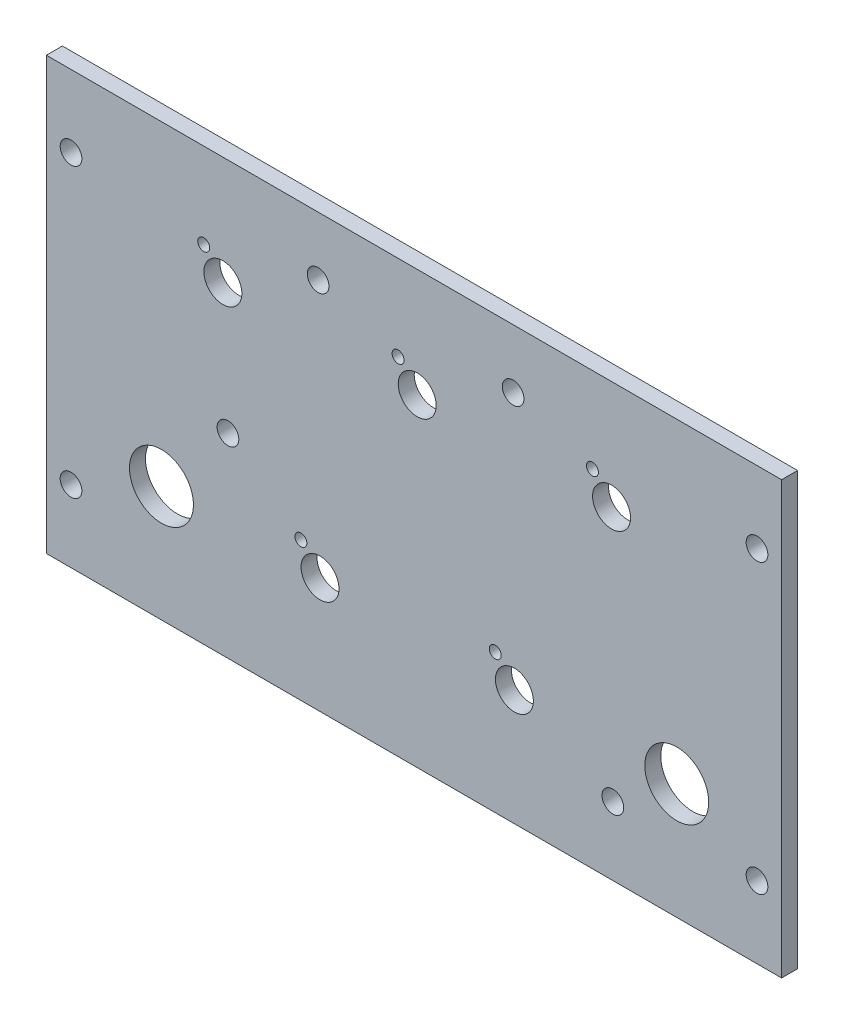
ISO-10303-21;
HEADER;
FILE_DESCRIPTION(('STEP AP214'),'2;1');
FILE_NAME('part.step','',(''),(''),'','','');
FILE_SCHEMA(('AUTOMOTIVE_DESIGN { 1 0 10303 214 1 1 1 1 }'));
ENDSEC;
DATA;
#1=APPLICATION_CONTEXT('core data for automotive mechanical design processes');
#2=APPLICATION_PROTOCOL_DEFINITION('international standard','automotive_design',2000,#1);
#3=PRODUCT_CONTEXT('',#1,'mechanical');
#4=PRODUCT('Part','Part','',(#3));
#5=PRODUCT_RELATED_PRODUCT_CATEGORY('part','',(#4));
#6=PRODUCT_DEFINITION_FORMATION('','',#4);
#7=PRODUCT_DEFINITION_CONTEXT('part definition',#1,'design');
#8=PRODUCT_DEFINITION('design','',#6,#7);
#9=PRODUCT_DEFINITION_SHAPE('','',#8);
#10=(LENGTH_UNIT() NAMED_UNIT(*) SI_UNIT(.MILLI.,.METRE.));
#11=(NAMED_UNIT(*) PLANE_ANGLE_UNIT() SI_UNIT($,.RADIAN.));
#12=(NAMED_UNIT(*) SI_UNIT($,.STERADIAN.) SOLID_ANGLE_UNIT());
#13=UNCERTAINTY_MEASURE_WITH_UNIT(LENGTH_MEASURE(1.E-05),#10,'distance_accuracy_value','');
#14=(GEOMETRIC_REPRESENTATION_CONTEXT(3) GLOBAL_UNCERTAINTY_ASSIGNED_CONTEXT((#13)) GLOBAL_UNIT_ASSIGNED_CONTEXT((#10,
#11,#12)) REPRESENTATION_CONTEXT('',''));
#15=CARTESIAN_POINT('',(0.,0.,0.));
#16=DIRECTION('',(0.,0.,1.));
#17=DIRECTION('',(1.,0.,0.));
#18=AXIS2_PLACEMENT_3D('',#15,#16,#17);
#19=CARTESIAN_POINT('',(0.,0.,-3.175));
#20=DIRECTION('',(1.,0.,0.));
#21=DIRECTION('',(0.,1.,0.));
#22=AXIS2_PLACEMENT_3D('',#19,#20,#21);
#23=PLANE('',#22);
#24=DIRECTION('',(0.,1.,0.));
#25=VECTOR('',#24,1.);
#26=CARTESIAN_POINT('',(0.,0.,0.));
#27=LINE('',#26,#25);
#28=CARTESIAN_POINT('',(0.,0.,0.));
#29=VERTEX_POINT('',#28);
#30=CARTESIAN_POINT('',(0.,85.725,0.));
#31=VERTEX_POINT('',#30);
#32=EDGE_CURVE('E104',#29,#31,#27,.T.);
#33=ORIENTED_EDGE('',*,*,#32,.F.);
#34=DIRECTION('',(0.,0.,1.));
#35=VECTOR('',#34,1.);
#36=CARTESIAN_POINT('',(0.,0.,-3.175));
#37=LINE('',#36,#35);
#38=CARTESIAN_POINT('',(0.,0.,-3.175));
#39=VERTEX_POINT('',#38);
#40=EDGE_CURVE('E11',#39,#29,#37,.T.);
#41=ORIENTED_EDGE('',*,*,#40,.F.);
#42=DIRECTION('',(0.,1.,0.));
#43=VECTOR('',#42,1.);
#44=CARTESIAN_POINT('',(0.,0.,-3.175));
#45=LINE('',#44,#43);
#46=CARTESIAN_POINT('',(0.,85.725,-3.175));
#47=VERTEX_POINT('',#46);
#48=EDGE_CURVE('E97',#39,#47,#45,.T.);
#49=ORIENTED_EDGE('',*,*,#48,.T.);
#50=DIRECTION('',(0.,0.,1.));
#51=VECTOR('',#50,1.);
#52=CARTESIAN_POINT('',(0.,85.725,-3.175));
#53=LINE('',#52,#51);
#54=EDGE_CURVE('E80',#47,#31,#53,.T.);
#55=ORIENTED_EDGE('',*,*,#54,.T.);
#56=EDGE_LOOP('',(#33,#41,#49,#55));
#57=FACE_BOUND('',#56,.T.);
#58=ADVANCED_FACE('F37',(#57),#23,.T.);
#59=CARTESIAN_POINT('',(-146.05,0.,-3.175));
#60=DIRECTION('',(0.,-1.,0.));
#61=DIRECTION('',(1.,0.,0.));
#62=AXIS2_PLACEMENT_3D('',#59,#60,#61);
#63=PLANE('',#62);
#64=DIRECTION('',(1.,0.,0.));
#65=VECTOR('',#64,1.);
#66=CARTESIAN_POINT('',(-146.05,0.,0.));
#67=LINE('',#66,#65);
#68=CARTESIAN_POINT('',(-146.05,0.,0.));
#69=VERTEX_POINT('',#68);
#70=EDGE_CURVE('E99',#69,#29,#67,.T.);
#71=ORIENTED_EDGE('',*,*,#70,.F.);
#72=DIRECTION('',(0.,0.,1.));
#73=VECTOR('',#72,1.);
#74=CARTESIAN_POINT('',(-146.05,0.,-3.175));
#75=LINE('',#74,#73);
#76=CARTESIAN_POINT('',(-146.05,0.,-3.175));
#77=VERTEX_POINT('',#76);
#78=EDGE_CURVE('E46',#77,#69,#75,.T.);
#79=ORIENTED_EDGE('',*,*,#78,.F.);
#80=DIRECTION('',(1.,0.,0.));
#81=VECTOR('',#80,1.);
#82=CARTESIAN_POINT('',(-146.05,0.,-3.175));
#83=LINE('',#82,#81);
#84=EDGE_CURVE('E94',#77,#39,#83,.T.);
#85=ORIENTED_EDGE('',*,*,#84,.T.);
#86=ORIENTED_EDGE('',*,*,#40,.T.);
#87=EDGE_LOOP('',(#71,#79,#85,#86));
#88=FACE_BOUND('',#87,.T.);
#89=ADVANCED_FACE('F115',(#88),#63,.T.);
#90=CARTESIAN_POINT('',(-146.05,85.725,-3.175));
#91=DIRECTION('',(-1.,0.,0.));
#92=DIRECTION('',(0.,0.,1.));
#93=AXIS2_PLACEMENT_3D('',#90,#91,#92);
#94=PLANE('',#93);
#95=DIRECTION('',(0.,-1.,0.));
#96=VECTOR('',#95,1.);
#97=CARTESIAN_POINT('',(-146.05,85.725,0.));
#98=LINE('',#97,#96);
#99=CARTESIAN_POINT('',(-146.05,85.725,0.));
#100=VERTEX_POINT('',#99);
#101=EDGE_CURVE('E88',#100,#69,#98,.T.);
#102=ORIENTED_EDGE('',*,*,#101,.F.);
#103=DIRECTION('',(0.,0.,1.));
#104=VECTOR('',#103,1.);
#105=CARTESIAN_POINT('',(-146.05,85.725,-3.175));
#106=LINE('',#105,#104);
#107=CARTESIAN_POINT('',(-146.05,85.725,-3.175));
#108=VERTEX_POINT('',#107);
#109=EDGE_CURVE('E83',#108,#100,#106,.T.);
#110=ORIENTED_EDGE('',*,*,#109,.F.);
#111=DIRECTION('',(0.,-1.,0.));
#112=VECTOR('',#111,1.);
#113=CARTESIAN_POINT('',(-146.05,85.725,-3.175));
#114=LINE('',#113,#112);
#115=EDGE_CURVE('E86',#108,#77,#114,.T.);
#116=ORIENTED_EDGE('',*,*,#115,.T.);
#117=ORIENTED_EDGE('',*,*,#78,.T.);
#118=EDGE_LOOP('',(#102,#110,#116,#117));
#119=FACE_BOUND('',#118,.T.);
#120=ADVANCED_FACE('F85',(#119),#94,.T.);
#121=CARTESIAN_POINT('',(0.,85.725,-3.175));
#122=DIRECTION('',(0.,1.,0.));
#123=DIRECTION('',(-1.,0.,0.));
#124=AXIS2_PLACEMENT_3D('',#121,#122,#123);
#125=PLANE('',#124);
#126=DIRECTION('',(-1.,0.,0.));
#127=VECTOR('',#126,1.);
#128=CARTESIAN_POINT('',(0.,85.725,0.));
#129=LINE('',#128,#127);
#130=EDGE_CURVE('E107',#31,#100,#129,.T.);
#131=ORIENTED_EDGE('',*,*,#130,.F.);
#132=ORIENTED_EDGE('',*,*,#54,.F.);
#133=DIRECTION('',(-1.,0.,0.));
#134=VECTOR('',#133,1.);
#135=CARTESIAN_POINT('',(0.,85.725,-3.175));
#136=LINE('',#135,#134);
#137=EDGE_CURVE('E93',#47,#108,#136,.T.);
#138=ORIENTED_EDGE('',*,*,#137,.T.);
#139=ORIENTED_EDGE('',*,*,#109,.T.);
#140=EDGE_LOOP('',(#131,#132,#138,#139));
#141=FACE_BOUND('',#140,.T.);
#142=ADVANCED_FACE('F96',(#141),#125,.T.);
#143=CARTESIAN_POINT('',(0.,0.,-3.175));
#144=DIRECTION('',(0.,0.,1.));
#145=DIRECTION('',(1.,0.,0.));
#146=AXIS2_PLACEMENT_3D('',#143,#144,#145);
#147=PLANE('',#146);
#148=CARTESIAN_POINT('',(-95.4942852562506,27.630041241585,-3.175));
#149=DIRECTION('',(0.,0.,-1.));
#150=DIRECTION('',(-1.,0.,0.));
#151=AXIS2_PLACEMENT_3D('',#148,#149,#150);
#152=CIRCLE('',#151,1.190625);
#153=CARTESIAN_POINT('',(-96.6849102562506,27.630041241585,-3.175));
#154=VERTEX_POINT('',#153);
#155=EDGE_CURVE('E223',#154,#154,#152,.T.);
#156=ORIENTED_EDGE('',*,*,#155,.F.);
#157=EDGE_LOOP('',(#156));
#158=FACE_BOUND('',#157,.T.);
#159=CARTESIAN_POINT('',(-56.8862852562526,27.6300412415876,-3.175));
#160=DIRECTION('',(0.,0.,-1.));
#161=DIRECTION('',(-1.,0.,0.));
#162=AXIS2_PLACEMENT_3D('',#159,#160,#161);
#163=CIRCLE('',#162,1.190625);
#164=CARTESIAN_POINT('',(-58.0769102562526,27.6300412415876,-3.175));
#165=VERTEX_POINT('',#164);
#166=EDGE_CURVE('E225',#165,#165,#163,.T.);
#167=ORIENTED_EDGE('',*,*,#166,.F.);
#168=EDGE_LOOP('',(#167));
#169=FACE_BOUND('',#168,.T.);
#170=CARTESIAN_POINT('',(-114.798285256253,68.7780412415856,-3.175));
#171=DIRECTION('',(0.,0.,-1.));
#172=DIRECTION('',(-1.,0.,0.));
#173=AXIS2_PLACEMENT_3D('',#170,#171,#172);
#174=CIRCLE('',#173,1.190625);
#175=CARTESIAN_POINT('',(-115.988910256253,68.7780412415856,-3.175));
#176=VERTEX_POINT('',#175);
#177=EDGE_CURVE('E231',#176,#176,#174,.T.);
#178=ORIENTED_EDGE('',*,*,#177,.F.);
#179=EDGE_LOOP('',(#178));
#180=FACE_BOUND('',#179,.T.);
#181=CARTESIAN_POINT('',(-76.1902852562501,68.7780412415874,-3.175));
#182=DIRECTION('',(0.,0.,-1.));
#183=DIRECTION('',(-1.,0.,0.));
#184=AXIS2_PLACEMENT_3D('',#181,#182,#183);
#185=CIRCLE('',#184,1.190625);
#186=CARTESIAN_POINT('',(-77.3809102562501,68.7780412415874,-3.175));
#187=VERTEX_POINT('',#186);
#188=EDGE_CURVE('E237',#187,#187,#185,.T.);
#189=ORIENTED_EDGE('',*,*,#188,.F.);
#190=EDGE_LOOP('',(#189));
#191=FACE_BOUND('',#190,.T.);
#192=CARTESIAN_POINT('',(-37.5822852562497,68.77804124159,-3.175));
#193=DIRECTION('',(0.,0.,-1.));
#194=DIRECTION('',(-1.,0.,0.));
#195=AXIS2_PLACEMENT_3D('',#192,#193,#194);
#196=CIRCLE('',#195,1.190625);
#197=CARTESIAN_POINT('',(-38.7729102562497,68.77804124159,-3.175));
#198=VERTEX_POINT('',#197);
#199=EDGE_CURVE('E243',#198,#198,#196,.T.);
#200=ORIENTED_EDGE('',*,*,#199,.F.);
#201=EDGE_LOOP('',(#200));
#202=FACE_BOUND('',#201,.T.);
#203=CARTESIAN_POINT('',(-53.086000000004,22.9869999999988,-3.175));
#204=DIRECTION('',(0.,0.,-1.));
#205=DIRECTION('',(-1.,0.,0.));
#206=AXIS2_PLACEMENT_3D('',#203,#204,#205);
#207=CIRCLE('',#206,3.7703125);
#208=CARTESIAN_POINT('',(-56.856312500004,22.9869999999988,-3.175));
#209=VERTEX_POINT('',#208);
#210=EDGE_CURVE('E250',#209,#209,#207,.T.);
#211=ORIENTED_EDGE('',*,*,#210,.F.);
#212=EDGE_LOOP('',(#211));
#213=FACE_BOUND('',#212,.T.);
#214=CARTESIAN_POINT('',(-91.6940000000019,22.9869999999961,-3.175));
#215=DIRECTION('',(0.,0.,-1.));
#216=DIRECTION('',(-1.,0.,0.));
#217=AXIS2_PLACEMENT_3D('',#214,#215,#216);
#218=CIRCLE('',#217,3.7703125);
#219=CARTESIAN_POINT('',(-95.4643125000019,22.9869999999961,-3.175));
#220=VERTEX_POINT('',#219);
#221=EDGE_CURVE('E257',#220,#220,#218,.T.);
#222=ORIENTED_EDGE('',*,*,#221,.F.);
#223=EDGE_LOOP('',(#222));
#224=FACE_BOUND('',#223,.T.);
#225=CARTESIAN_POINT('',(-110.998000000004,64.1349999999967,-3.175));
#226=DIRECTION('',(0.,0.,-1.));
#227=DIRECTION('',(-1.,0.,0.));
#228=AXIS2_PLACEMENT_3D('',#225,#226,#227);
#229=CIRCLE('',#228,3.7703125);
#230=CARTESIAN_POINT('',(-114.768312500004,64.1349999999967,-3.175));
#231=VERTEX_POINT('',#230);
#232=EDGE_CURVE('E263',#231,#231,#229,.T.);
#233=ORIENTED_EDGE('',*,*,#232,.F.);
#234=EDGE_LOOP('',(#233));
#235=FACE_BOUND('',#234,.T.);
#236=CARTESIAN_POINT('',(-72.3900000000015,64.1349999999985,-3.175));
#237=DIRECTION('',(0.,0.,-1.));
#238=DIRECTION('',(-1.,0.,0.));
#239=AXIS2_PLACEMENT_3D('',#236,#237,#238);
#240=CIRCLE('',#239,3.7703125);
#241=CARTESIAN_POINT('',(-76.1603125000015,64.1349999999985,-3.175));
#242=VERTEX_POINT('',#241);
#243=EDGE_CURVE('E269',#242,#242,#240,.T.);
#244=ORIENTED_EDGE('',*,*,#243,.F.);
#245=EDGE_LOOP('',(#244));
#246=FACE_BOUND('',#245,.T.);
#247=CARTESIAN_POINT('',(-33.7820000000011,64.1350000000012,-3.175));
#248=DIRECTION('',(0.,0.,-1.));
#249=DIRECTION('',(-1.,0.,0.));
#250=AXIS2_PLACEMENT_3D('',#247,#248,#249);
#251=CIRCLE('',#250,3.7703125);
#252=CARTESIAN_POINT('',(-37.5523125000011,64.1350000000012,-3.175));
#253=VERTEX_POINT('',#252);
#254=EDGE_CURVE('E275',#253,#253,#251,.T.);
#255=ORIENTED_EDGE('',*,*,#254,.F.);
#256=EDGE_LOOP('',(#255));
#257=FACE_BOUND('',#256,.T.);
#258=CARTESIAN_POINT('',(-123.19,22.987,-3.175));
#259=DIRECTION('',(0.,0.,-1.));
#260=DIRECTION('',(-1.,0.,0.));
#261=AXIS2_PLACEMENT_3D('',#258,#259,#260);
#262=CIRCLE('',#261,6.35000000000001);
#263=CARTESIAN_POINT('',(-129.54,22.987,-3.175));
#264=VERTEX_POINT('',#263);
#265=EDGE_CURVE('E282',#264,#264,#262,.T.);
#266=ORIENTED_EDGE('',*,*,#265,.F.);
#267=EDGE_LOOP('',(#266));
#268=FACE_BOUND('',#267,.T.);
#269=CARTESIAN_POINT('',(-20.828,22.987,-3.175));
#270=DIRECTION('',(0.,0.,-1.));
#271=DIRECTION('',(-1.,0.,0.));
#272=AXIS2_PLACEMENT_3D('',#269,#270,#271);
#273=CIRCLE('',#272,6.35);
#274=CARTESIAN_POINT('',(-27.178,22.987,-3.175));
#275=VERTEX_POINT('',#274);
#276=EDGE_CURVE('E289',#275,#275,#273,.T.);
#277=ORIENTED_EDGE('',*,*,#276,.F.);
#278=EDGE_LOOP('',(#277));
#279=FACE_BOUND('',#278,.T.);
#280=CARTESIAN_POINT('',(-4.88949999999995,71.4375,-3.175));
#281=DIRECTION('',(0.,0.,-1.));
#282=DIRECTION('',(-1.,0.,0.));
#283=AXIS2_PLACEMENT_3D('',#280,#281,#282);
#284=CIRCLE('',#283,2.15264999999999);
#285=CARTESIAN_POINT('',(-7.04214999999994,71.4375,-3.175));
#286=VERTEX_POINT('',#285);
#287=EDGE_CURVE('E295',#286,#286,#284,.T.);
#288=ORIENTED_EDGE('',*,*,#287,.F.);
#289=EDGE_LOOP('',(#288));
#290=FACE_BOUND('',#289,.T.);
#291=CARTESIAN_POINT('',(-53.34,74.041,-3.175));
#292=DIRECTION('',(0.,0.,-1.));
#293=DIRECTION('',(-1.,0.,0.));
#294=AXIS2_PLACEMENT_3D('',#291,#292,#293);
#295=CIRCLE('',#294,2.15264999999999);
#296=CARTESIAN_POINT('',(-55.49265,74.041,-3.175));
#297=VERTEX_POINT('',#296);
#298=EDGE_CURVE('E303',#297,#297,#295,.T.);
#299=ORIENTED_EDGE('',*,*,#298,.F.);
#300=EDGE_LOOP('',(#299));
#301=FACE_BOUND('',#300,.T.);
#302=CARTESIAN_POINT('',(-92.075,74.041,-3.175));
#303=DIRECTION('',(0.,0.,-1.));
#304=DIRECTION('',(-1.,0.,0.));
#305=AXIS2_PLACEMENT_3D('',#302,#303,#304);
#306=CIRCLE('',#305,2.15264999999999);
#307=CARTESIAN_POINT('',(-94.22765,74.041,-3.175));
#308=VERTEX_POINT('',#307);
#309=EDGE_CURVE('E306',#308,#308,#306,.T.);
#310=ORIENTED_EDGE('',*,*,#309,.F.);
#311=EDGE_LOOP('',(#310));
#312=FACE_BOUND('',#311,.T.);
#313=CARTESIAN_POINT('',(-141.1605,71.4375,-3.175));
#314=DIRECTION('',(0.,0.,-1.));
#315=DIRECTION('',(-1.,0.,0.));
#316=AXIS2_PLACEMENT_3D('',#313,#314,#315);
#317=CIRCLE('',#316,2.15264999999998);
#318=CARTESIAN_POINT('',(-143.31315,71.4375,-3.175));
#319=VERTEX_POINT('',#318);
#320=EDGE_CURVE('E312',#319,#319,#317,.T.);
#321=ORIENTED_EDGE('',*,*,#320,.F.);
#322=EDGE_LOOP('',(#321));
#323=FACE_BOUND('',#322,.T.);
#324=CARTESIAN_POINT('',(-109.982,38.735,-3.175));
#325=DIRECTION('',(0.,0.,-1.));
#326=DIRECTION('',(-1.,0.,0.));
#327=AXIS2_PLACEMENT_3D('',#324,#325,#326);
#328=CIRCLE('',#327,2.15264999999999);
#329=CARTESIAN_POINT('',(-112.13465,38.735,-3.175));
#330=VERTEX_POINT('',#329);
#331=EDGE_CURVE('E318',#330,#330,#328,.T.);
#332=ORIENTED_EDGE('',*,*,#331,.F.);
#333=EDGE_LOOP('',(#332));
#334=FACE_BOUND('',#333,.T.);
#335=CARTESIAN_POINT('',(-141.1605,14.2875,-3.175));
#336=DIRECTION('',(0.,0.,-1.));
#337=DIRECTION('',(-1.,0.,0.));
#338=AXIS2_PLACEMENT_3D('',#335,#336,#337);
#339=CIRCLE('',#338,2.15264999999998);
#340=CARTESIAN_POINT('',(-143.31315,14.2875,-3.175));
#341=VERTEX_POINT('',#340);
#342=EDGE_CURVE('E324',#341,#341,#339,.T.);
#343=ORIENTED_EDGE('',*,*,#342,.F.);
#344=EDGE_LOOP('',(#343));
#345=FACE_BOUND('',#344,.T.);
#346=CARTESIAN_POINT('',(-33.528,13.589,-3.175));
#347=DIRECTION('',(0.,0.,-1.));
#348=DIRECTION('',(-1.,0.,0.));
#349=AXIS2_PLACEMENT_3D('',#346,#347,#348);
#350=CIRCLE('',#349,2.15264999999999);
#351=CARTESIAN_POINT('',(-35.68065,13.589,-3.175));
#352=VERTEX_POINT('',#351);
#353=EDGE_CURVE('E330',#352,#352,#350,.T.);
#354=ORIENTED_EDGE('',*,*,#353,.F.);
#355=EDGE_LOOP('',(#354));
#356=FACE_BOUND('',#355,.T.);
#357=CARTESIAN_POINT('',(-4.88949999999995,14.2875,-3.175));
#358=DIRECTION('',(0.,0.,-1.));
#359=DIRECTION('',(-1.,0.,0.));
#360=AXIS2_PLACEMENT_3D('',#357,#358,#359);
#361=CIRCLE('',#360,2.15264999999999);
#362=CARTESIAN_POINT('',(-7.04214999999994,14.2875,-3.175));
#363=VERTEX_POINT('',#362);
#364=EDGE_CURVE('E336',#363,#363,#361,.T.);
#365=ORIENTED_EDGE('',*,*,#364,.F.);
#366=EDGE_LOOP('',(#365));
#367=FACE_BOUND('',#366,.T.);
#368=ORIENTED_EDGE('',*,*,#48,.F.);
#369=ORIENTED_EDGE('',*,*,#84,.F.);
#370=ORIENTED_EDGE('',*,*,#115,.F.);
#371=ORIENTED_EDGE('',*,*,#137,.F.);
#372=EDGE_LOOP('',(#368,#369,#370,#371));
#373=FACE_BOUND('',#372,.T.);
#374=ADVANCED_FACE('F92',(#158,#169,#180,#191,#202,#213,#224,#235,#246,#257,#268,#279,#290,#301,
#312,#323,#334,#345,#356,#367,#373),#147,.F.);
#375=CARTESIAN_POINT('',(0.,0.,0.));
#376=DIRECTION('',(0.,0.,1.));
#377=DIRECTION('',(1.,0.,0.));
#378=AXIS2_PLACEMENT_3D('',#375,#376,#377);
#379=PLANE('',#378);
#380=CARTESIAN_POINT('',(-95.4942852562506,27.630041241585,0.));
#381=DIRECTION('',(0.,0.,-1.));
#382=DIRECTION('',(-1.,0.,0.));
#383=AXIS2_PLACEMENT_3D('',#380,#381,#382);
#384=CIRCLE('',#383,1.190625);
#385=CARTESIAN_POINT('',(-96.6849102562506,27.630041241585,0.));
#386=VERTEX_POINT('',#385);
#387=EDGE_CURVE('E221',#386,#386,#384,.T.);
#388=ORIENTED_EDGE('',*,*,#387,.T.);
#389=EDGE_LOOP('',(#388));
#390=FACE_BOUND('',#389,.T.);
#391=CARTESIAN_POINT('',(-56.8862852562526,27.6300412415876,0.));
#392=DIRECTION('',(0.,0.,-1.));
#393=DIRECTION('',(-1.,0.,0.));
#394=AXIS2_PLACEMENT_3D('',#391,#392,#393);
#395=CIRCLE('',#394,1.190625);
#396=CARTESIAN_POINT('',(-58.0769102562526,27.6300412415876,0.));
#397=VERTEX_POINT('',#396);
#398=EDGE_CURVE('E228',#397,#397,#395,.T.);
#399=ORIENTED_EDGE('',*,*,#398,.T.);
#400=EDGE_LOOP('',(#399));
#401=FACE_BOUND('',#400,.T.);
#402=CARTESIAN_POINT('',(-114.798285256253,68.7780412415856,0.));
#403=DIRECTION('',(0.,0.,-1.));
#404=DIRECTION('',(-1.,0.,0.));
#405=AXIS2_PLACEMENT_3D('',#402,#403,#404);
#406=CIRCLE('',#405,1.190625);
#407=CARTESIAN_POINT('',(-115.988910256253,68.7780412415856,0.));
#408=VERTEX_POINT('',#407);
#409=EDGE_CURVE('E234',#408,#408,#406,.T.);
#410=ORIENTED_EDGE('',*,*,#409,.T.);
#411=EDGE_LOOP('',(#410));
#412=FACE_BOUND('',#411,.T.);
#413=CARTESIAN_POINT('',(-76.1902852562501,68.7780412415874,0.));
#414=DIRECTION('',(0.,0.,-1.));
#415=DIRECTION('',(-1.,0.,0.));
#416=AXIS2_PLACEMENT_3D('',#413,#414,#415);
#417=CIRCLE('',#416,1.190625);
#418=CARTESIAN_POINT('',(-77.3809102562501,68.7780412415874,0.));
#419=VERTEX_POINT('',#418);
#420=EDGE_CURVE('E240',#419,#419,#417,.T.);
#421=ORIENTED_EDGE('',*,*,#420,.T.);
#422=EDGE_LOOP('',(#421));
#423=FACE_BOUND('',#422,.T.);
#424=CARTESIAN_POINT('',(-37.5822852562497,68.77804124159,0.));
#425=DIRECTION('',(0.,0.,-1.));
#426=DIRECTION('',(-1.,0.,0.));
#427=AXIS2_PLACEMENT_3D('',#424,#425,#426);
#428=CIRCLE('',#427,1.190625);
#429=CARTESIAN_POINT('',(-38.7729102562497,68.77804124159,0.));
#430=VERTEX_POINT('',#429);
#431=EDGE_CURVE('E246',#430,#430,#428,.T.);
#432=ORIENTED_EDGE('',*,*,#431,.T.);
#433=EDGE_LOOP('',(#432));
#434=FACE_BOUND('',#433,.T.);
#435=CARTESIAN_POINT('',(-53.086000000004,22.9869999999988,0.));
#436=DIRECTION('',(0.,0.,-1.));
#437=DIRECTION('',(-1.,0.,0.));
#438=AXIS2_PLACEMENT_3D('',#435,#436,#437);
#439=CIRCLE('',#438,3.7703125);
#440=CARTESIAN_POINT('',(-56.856312500004,22.9869999999988,0.));
#441=VERTEX_POINT('',#440);
#442=EDGE_CURVE('E254',#441,#441,#439,.T.);
#443=ORIENTED_EDGE('',*,*,#442,.T.);
#444=EDGE_LOOP('',(#443));
#445=FACE_BOUND('',#444,.T.);
#446=CARTESIAN_POINT('',(-91.6940000000019,22.9869999999961,0.));
#447=DIRECTION('',(0.,0.,-1.));
#448=DIRECTION('',(-1.,0.,0.));
#449=AXIS2_PLACEMENT_3D('',#446,#447,#448);
#450=CIRCLE('',#449,3.7703125);
#451=CARTESIAN_POINT('',(-95.4643125000019,22.9869999999961,0.));
#452=VERTEX_POINT('',#451);
#453=EDGE_CURVE('E260',#452,#452,#450,.T.);
#454=ORIENTED_EDGE('',*,*,#453,.T.);
#455=EDGE_LOOP('',(#454));
#456=FACE_BOUND('',#455,.T.);
#457=CARTESIAN_POINT('',(-110.998000000004,64.1349999999967,0.));
#458=DIRECTION('',(0.,0.,-1.));
#459=DIRECTION('',(-1.,0.,0.));
#460=AXIS2_PLACEMENT_3D('',#457,#458,#459);
#461=CIRCLE('',#460,3.7703125);
#462=CARTESIAN_POINT('',(-114.768312500004,64.1349999999967,0.));
#463=VERTEX_POINT('',#462);
#464=EDGE_CURVE('E266',#463,#463,#461,.T.);
#465=ORIENTED_EDGE('',*,*,#464,.T.);
#466=EDGE_LOOP('',(#465));
#467=FACE_BOUND('',#466,.T.);
#468=CARTESIAN_POINT('',(-72.3900000000015,64.1349999999985,0.));
#469=DIRECTION('',(0.,0.,-1.));
#470=DIRECTION('',(-1.,0.,0.));
#471=AXIS2_PLACEMENT_3D('',#468,#469,#470);
#472=CIRCLE('',#471,3.7703125);
#473=CARTESIAN_POINT('',(-76.1603125000015,64.1349999999985,0.));
#474=VERTEX_POINT('',#473);
#475=EDGE_CURVE('E272',#474,#474,#472,.T.);
#476=ORIENTED_EDGE('',*,*,#475,.T.);
#477=EDGE_LOOP('',(#476));
#478=FACE_BOUND('',#477,.T.);
#479=CARTESIAN_POINT('',(-33.7820000000011,64.1350000000012,0.));
#480=DIRECTION('',(0.,0.,-1.));
#481=DIRECTION('',(-1.,0.,0.));
#482=AXIS2_PLACEMENT_3D('',#479,#480,#481);
#483=CIRCLE('',#482,3.7703125);
#484=CARTESIAN_POINT('',(-37.5523125000011,64.1350000000012,0.));
#485=VERTEX_POINT('',#484);
#486=EDGE_CURVE('E278',#485,#485,#483,.T.);
#487=ORIENTED_EDGE('',*,*,#486,.T.);
#488=EDGE_LOOP('',(#487));
#489=FACE_BOUND('',#488,.T.);
#490=CARTESIAN_POINT('',(-123.19,22.987,0.));
#491=DIRECTION('',(0.,0.,-1.));
#492=DIRECTION('',(-1.,0.,0.));
#493=AXIS2_PLACEMENT_3D('',#490,#491,#492);
#494=CIRCLE('',#493,6.35000000000001);
#495=CARTESIAN_POINT('',(-129.54,22.987,0.));
#496=VERTEX_POINT('',#495);
#497=EDGE_CURVE('E286',#496,#496,#494,.T.);
#498=ORIENTED_EDGE('',*,*,#497,.T.);
#499=EDGE_LOOP('',(#498));
#500=FACE_BOUND('',#499,.T.);
#501=CARTESIAN_POINT('',(-20.828,22.987,0.));
#502=DIRECTION('',(0.,0.,-1.));
#503=DIRECTION('',(-1.,0.,0.));
#504=AXIS2_PLACEMENT_3D('',#501,#502,#503);
#505=CIRCLE('',#504,6.35);
#506=CARTESIAN_POINT('',(-27.178,22.987,0.));
#507=VERTEX_POINT('',#506);
#508=EDGE_CURVE('E292',#507,#507,#505,.T.);
#509=ORIENTED_EDGE('',*,*,#508,.T.);
#510=EDGE_LOOP('',(#509));
#511=FACE_BOUND('',#510,.T.);
#512=CARTESIAN_POINT('',(-4.88949999999995,71.4375,0.));
#513=DIRECTION('',(0.,0.,1.));
#514=DIRECTION('',(1.,0.,0.));
#515=AXIS2_PLACEMENT_3D('',#512,#513,#514);
#516=CIRCLE('',#515,2.15264999999999);
#517=CARTESIAN_POINT('',(-2.73684999999996,71.4375,0.));
#518=VERTEX_POINT('',#517);
#519=EDGE_CURVE('E300',#518,#518,#516,.T.);
#520=ORIENTED_EDGE('',*,*,#519,.F.);
#521=EDGE_LOOP('',(#520));
#522=FACE_BOUND('',#521,.T.);
#523=CARTESIAN_POINT('',(-53.34,74.041,0.));
#524=DIRECTION('',(0.,0.,1.));
#525=DIRECTION('',(1.,0.,0.));
#526=AXIS2_PLACEMENT_3D('',#523,#524,#525);
#527=CIRCLE('',#526,2.15264999999999);
#528=CARTESIAN_POINT('',(-51.18735,74.041,0.));
#529=VERTEX_POINT('',#528);
#530=EDGE_CURVE('E40',#529,#529,#527,.T.);
#531=ORIENTED_EDGE('',*,*,#530,.F.);
#532=EDGE_LOOP('',(#531));
#533=FACE_BOUND('',#532,.T.);
#534=CARTESIAN_POINT('',(-92.075,74.041,0.));
#535=DIRECTION('',(0.,0.,1.));
#536=DIRECTION('',(1.,0.,0.));
#537=AXIS2_PLACEMENT_3D('',#534,#535,#536);
#538=CIRCLE('',#537,2.15264999999999);
#539=CARTESIAN_POINT('',(-89.92235,74.041,0.));
#540=VERTEX_POINT('',#539);
#541=EDGE_CURVE('E309',#540,#540,#538,.T.);
#542=ORIENTED_EDGE('',*,*,#541,.F.);
#543=EDGE_LOOP('',(#542));
#544=FACE_BOUND('',#543,.T.);
#545=CARTESIAN_POINT('',(-141.1605,71.4375,0.));
#546=DIRECTION('',(0.,0.,1.));
#547=DIRECTION('',(1.,0.,0.));
#548=AXIS2_PLACEMENT_3D('',#545,#546,#547);
#549=CIRCLE('',#548,2.15264999999998);
#550=CARTESIAN_POINT('',(-139.00785,71.4375,0.));
#551=VERTEX_POINT('',#550);
#552=EDGE_CURVE('E315',#551,#551,#549,.T.);
#553=ORIENTED_EDGE('',*,*,#552,.F.);
#554=EDGE_LOOP('',(#553));
#555=FACE_BOUND('',#554,.T.);
#556=CARTESIAN_POINT('',(-109.982,38.735,0.));
#557=DIRECTION('',(0.,0.,1.));
#558=DIRECTION('',(1.,0.,0.));
#559=AXIS2_PLACEMENT_3D('',#556,#557,#558);
#560=CIRCLE('',#559,2.15264999999999);
#561=CARTESIAN_POINT('',(-107.82935,38.735,0.));
#562=VERTEX_POINT('',#561);
#563=EDGE_CURVE('E321',#562,#562,#560,.T.);
#564=ORIENTED_EDGE('',*,*,#563,.F.);
#565=EDGE_LOOP('',(#564));
#566=FACE_BOUND('',#565,.T.);
#567=CARTESIAN_POINT('',(-141.1605,14.2875,0.));
#568=DIRECTION('',(0.,0.,1.));
#569=DIRECTION('',(1.,0.,0.));
#570=AXIS2_PLACEMENT_3D('',#567,#568,#569);
#571=CIRCLE('',#570,2.15264999999998);
#572=CARTESIAN_POINT('',(-139.00785,14.2875,0.));
#573=VERTEX_POINT('',#572);
#574=EDGE_CURVE('E327',#573,#573,#571,.T.);
#575=ORIENTED_EDGE('',*,*,#574,.F.);
#576=EDGE_LOOP('',(#575));
#577=FACE_BOUND('',#576,.T.);
#578=CARTESIAN_POINT('',(-33.528,13.589,0.));
#579=DIRECTION('',(0.,0.,1.));
#580=DIRECTION('',(1.,0.,0.));
#581=AXIS2_PLACEMENT_3D('',#578,#579,#580);
#582=CIRCLE('',#581,2.15264999999999);
#583=CARTESIAN_POINT('',(-31.37535,13.589,0.));
#584=VERTEX_POINT('',#583);
#585=EDGE_CURVE('E333',#584,#584,#582,.T.);
#586=ORIENTED_EDGE('',*,*,#585,.F.);
#587=EDGE_LOOP('',(#586));
#588=FACE_BOUND('',#587,.T.);
#589=CARTESIAN_POINT('',(-4.88949999999995,14.2875,0.));
#590=DIRECTION('',(0.,0.,1.));
#591=DIRECTION('',(1.,0.,0.));
#592=AXIS2_PLACEMENT_3D('',#589,#590,#591);
#593=CIRCLE('',#592,2.15264999999999);
#594=CARTESIAN_POINT('',(-2.73684999999996,14.2875,0.));
#595=VERTEX_POINT('',#594);
#596=EDGE_CURVE('E108',#595,#595,#593,.T.);
#597=ORIENTED_EDGE('',*,*,#596,.F.);
#598=EDGE_LOOP('',(#597));
#599=FACE_BOUND('',#598,.T.);
#600=ORIENTED_EDGE('',*,*,#32,.T.);
#601=ORIENTED_EDGE('',*,*,#130,.T.);
#602=ORIENTED_EDGE('',*,*,#101,.T.);
#603=ORIENTED_EDGE('',*,*,#70,.T.);
#604=EDGE_LOOP('',(#600,#601,#602,#603));
#605=FACE_BOUND('',#604,.T.);
#606=ADVANCED_FACE('F114',(#390,#401,#412,#423,#434,#445,#456,#467,#478,#489,#500,#511,#522,
#533,#544,#555,#566,#577,#588,#599,#605),#379,.T.);
#607=CARTESIAN_POINT('',(-4.88949999999995,14.2875,-3.175));
#608=DIRECTION('',(0.,0.,-1.));
#609=DIRECTION('',(-1.,0.,0.));
#610=AXIS2_PLACEMENT_3D('',#607,#608,#609);
#611=CYLINDRICAL_SURFACE('',#610,2.15264999999999);
#612=ORIENTED_EDGE('',*,*,#596,.T.);
#613=EDGE_LOOP('',(#612));
#614=FACE_BOUND('',#613,.T.);
#615=ORIENTED_EDGE('',*,*,#364,.T.);
#616=EDGE_LOOP('',(#615));
#617=FACE_BOUND('',#616,.T.);
#618=ADVANCED_FACE('F133',(#614,#617),#611,.F.);
#619=CARTESIAN_POINT('',(-33.528,13.589,-3.175));
#620=DIRECTION('',(0.,0.,-1.));
#621=DIRECTION('',(-1.,0.,0.));
#622=AXIS2_PLACEMENT_3D('',#619,#620,#621);
#623=CYLINDRICAL_SURFACE('',#622,2.15264999999999);
#624=ORIENTED_EDGE('',*,*,#585,.T.);
#625=EDGE_LOOP('',(#624));
#626=FACE_BOUND('',#625,.T.);
#627=ORIENTED_EDGE('',*,*,#353,.T.);
#628=EDGE_LOOP('',(#627));
#629=FACE_BOUND('',#628,.T.);
#630=ADVANCED_FACE('F140',(#626,#629),#623,.F.);
#631=CARTESIAN_POINT('',(-141.1605,14.2875,-3.175));
#632=DIRECTION('',(0.,0.,-1.));
#633=DIRECTION('',(-1.,0.,0.));
#634=AXIS2_PLACEMENT_3D('',#631,#632,#633);
#635=CYLINDRICAL_SURFACE('',#634,2.15264999999998);
#636=ORIENTED_EDGE('',*,*,#574,.T.);
#637=EDGE_LOOP('',(#636));
#638=FACE_BOUND('',#637,.T.);
#639=ORIENTED_EDGE('',*,*,#342,.T.);
#640=EDGE_LOOP('',(#639));
#641=FACE_BOUND('',#640,.T.);
#642=ADVANCED_FACE('F144',(#638,#641),#635,.F.);
#643=CARTESIAN_POINT('',(-109.982,38.735,-3.175));
#644=DIRECTION('',(0.,0.,-1.));
#645=DIRECTION('',(-1.,0.,0.));
#646=AXIS2_PLACEMENT_3D('',#643,#644,#645);
#647=CYLINDRICAL_SURFACE('',#646,2.15264999999999);
#648=ORIENTED_EDGE('',*,*,#563,.T.);
#649=EDGE_LOOP('',(#648));
#650=FACE_BOUND('',#649,.T.);
#651=ORIENTED_EDGE('',*,*,#331,.T.);
#652=EDGE_LOOP('',(#651));
#653=FACE_BOUND('',#652,.T.);
#654=ADVANCED_FACE('F148',(#650,#653),#647,.F.);
#655=CARTESIAN_POINT('',(-141.1605,71.4375,-3.175));
#656=DIRECTION('',(0.,0.,-1.));
#657=DIRECTION('',(-1.,0.,0.));
#658=AXIS2_PLACEMENT_3D('',#655,#656,#657);
#659=CYLINDRICAL_SURFACE('',#658,2.15264999999998);
#660=ORIENTED_EDGE('',*,*,#552,.T.);
#661=EDGE_LOOP('',(#660));
#662=FACE_BOUND('',#661,.T.);
#663=ORIENTED_EDGE('',*,*,#320,.T.);
#664=EDGE_LOOP('',(#663));
#665=FACE_BOUND('',#664,.T.);
#666=ADVANCED_FACE('F152',(#662,#665),#659,.F.);
#667=CARTESIAN_POINT('',(-92.075,74.041,-3.175));
#668=DIRECTION('',(0.,0.,-1.));
#669=DIRECTION('',(-1.,0.,0.));
#670=AXIS2_PLACEMENT_3D('',#667,#668,#669);
#671=CYLINDRICAL_SURFACE('',#670,2.15264999999999);
#672=ORIENTED_EDGE('',*,*,#541,.T.);
#673=EDGE_LOOP('',(#672));
#674=FACE_BOUND('',#673,.T.);
#675=ORIENTED_EDGE('',*,*,#309,.T.);
#676=EDGE_LOOP('',(#675));
#677=FACE_BOUND('',#676,.T.);
#678=ADVANCED_FACE('F156',(#674,#677),#671,.F.);
#679=CARTESIAN_POINT('',(-53.34,74.041,-3.175));
#680=DIRECTION('',(0.,0.,-1.));
#681=DIRECTION('',(-1.,0.,0.));
#682=AXIS2_PLACEMENT_3D('',#679,#680,#681);
#683=CYLINDRICAL_SURFACE('',#682,2.15264999999999);
#684=ORIENTED_EDGE('',*,*,#530,.T.);
#685=EDGE_LOOP('',(#684));
#686=FACE_BOUND('',#685,.T.);
#687=ORIENTED_EDGE('',*,*,#298,.T.);
#688=EDGE_LOOP('',(#687));
#689=FACE_BOUND('',#688,.T.);
#690=ADVANCED_FACE('F160',(#686,#689),#683,.F.);
#691=CARTESIAN_POINT('',(-4.88949999999995,71.4375,-3.175));
#692=DIRECTION('',(0.,0.,-1.));
#693=DIRECTION('',(-1.,0.,0.));
#694=AXIS2_PLACEMENT_3D('',#691,#692,#693);
#695=CYLINDRICAL_SURFACE('',#694,2.15264999999999);
#696=ORIENTED_EDGE('',*,*,#519,.T.);
#697=EDGE_LOOP('',(#696));
#698=FACE_BOUND('',#697,.T.);
#699=ORIENTED_EDGE('',*,*,#287,.T.);
#700=EDGE_LOOP('',(#699));
#701=FACE_BOUND('',#700,.T.);
#702=ADVANCED_FACE('F164',(#698,#701),#695,.F.);
#703=CARTESIAN_POINT('',(-20.828,22.987,0.));
#704=DIRECTION('',(0.,0.,-1.));
#705=DIRECTION('',(-1.,0.,0.));
#706=AXIS2_PLACEMENT_3D('',#703,#704,#705);
#707=CYLINDRICAL_SURFACE('',#706,6.35);
#708=ORIENTED_EDGE('',*,*,#508,.F.);
#709=EDGE_LOOP('',(#708));
#710=FACE_BOUND('',#709,.T.);
#711=ORIENTED_EDGE('',*,*,#276,.T.);
#712=EDGE_LOOP('',(#711));
#713=FACE_BOUND('',#712,.T.);
#714=ADVANCED_FACE('F168',(#710,#713),#707,.F.);
#715=CARTESIAN_POINT('',(-123.19,22.987,0.));
#716=DIRECTION('',(0.,0.,-1.));
#717=DIRECTION('',(-1.,0.,0.));
#718=AXIS2_PLACEMENT_3D('',#715,#716,#717);
#719=CYLINDRICAL_SURFACE('',#718,6.35000000000001);
#720=ORIENTED_EDGE('',*,*,#497,.F.);
#721=EDGE_LOOP('',(#720));
#722=FACE_BOUND('',#721,.T.);
#723=ORIENTED_EDGE('',*,*,#265,.T.);
#724=EDGE_LOOP('',(#723));
#725=FACE_BOUND('',#724,.T.);
#726=ADVANCED_FACE('F172',(#722,#725),#719,.F.);
#727=CARTESIAN_POINT('',(-33.7820000000011,64.1350000000012,0.));
#728=DIRECTION('',(0.,0.,-1.));
#729=DIRECTION('',(-1.,0.,0.));
#730=AXIS2_PLACEMENT_3D('',#727,#728,#729);
#731=CYLINDRICAL_SURFACE('',#730,3.7703125);
#732=ORIENTED_EDGE('',*,*,#486,.F.);
#733=EDGE_LOOP('',(#732));
#734=FACE_BOUND('',#733,.T.);
#735=ORIENTED_EDGE('',*,*,#254,.T.);
#736=EDGE_LOOP('',(#735));
#737=FACE_BOUND('',#736,.T.);
#738=ADVANCED_FACE('F176',(#734,#737),#731,.F.);
#739=CARTESIAN_POINT('',(-72.3900000000015,64.1349999999985,0.));
#740=DIRECTION('',(0.,0.,-1.));
#741=DIRECTION('',(-1.,0.,0.));
#742=AXIS2_PLACEMENT_3D('',#739,#740,#741);
#743=CYLINDRICAL_SURFACE('',#742,3.7703125);
#744=ORIENTED_EDGE('',*,*,#475,.F.);
#745=EDGE_LOOP('',(#744));
#746=FACE_BOUND('',#745,.T.);
#747=ORIENTED_EDGE('',*,*,#243,.T.);
#748=EDGE_LOOP('',(#747));
#749=FACE_BOUND('',#748,.T.);
#750=ADVANCED_FACE('F180',(#746,#749),#743,.F.);
#751=CARTESIAN_POINT('',(-110.998000000004,64.1349999999967,0.));
#752=DIRECTION('',(0.,0.,-1.));
#753=DIRECTION('',(-1.,0.,0.));
#754=AXIS2_PLACEMENT_3D('',#751,#752,#753);
#755=CYLINDRICAL_SURFACE('',#754,3.7703125);
#756=ORIENTED_EDGE('',*,*,#464,.F.);
#757=EDGE_LOOP('',(#756));
#758=FACE_BOUND('',#757,.T.);
#759=ORIENTED_EDGE('',*,*,#232,.T.);
#760=EDGE_LOOP('',(#759));
#761=FACE_BOUND('',#760,.T.);
#762=ADVANCED_FACE('F184',(#758,#761),#755,.F.);
#763=CARTESIAN_POINT('',(-91.6940000000019,22.9869999999961,0.));
#764=DIRECTION('',(0.,0.,-1.));
#765=DIRECTION('',(-1.,0.,0.));
#766=AXIS2_PLACEMENT_3D('',#763,#764,#765);
#767=CYLINDRICAL_SURFACE('',#766,3.7703125);
#768=ORIENTED_EDGE('',*,*,#453,.F.);
#769=EDGE_LOOP('',(#768));
#770=FACE_BOUND('',#769,.T.);
#771=ORIENTED_EDGE('',*,*,#221,.T.);
#772=EDGE_LOOP('',(#771));
#773=FACE_BOUND('',#772,.T.);
#774=ADVANCED_FACE('F188',(#770,#773),#767,.F.);
#775=CARTESIAN_POINT('',(-53.086000000004,22.9869999999988,0.));
#776=DIRECTION('',(0.,0.,-1.));
#777=DIRECTION('',(-1.,0.,0.));
#778=AXIS2_PLACEMENT_3D('',#775,#776,#777);
#779=CYLINDRICAL_SURFACE('',#778,3.7703125);
#780=ORIENTED_EDGE('',*,*,#442,.F.);
#781=EDGE_LOOP('',(#780));
#782=FACE_BOUND('',#781,.T.);
#783=ORIENTED_EDGE('',*,*,#210,.T.);
#784=EDGE_LOOP('',(#783));
#785=FACE_BOUND('',#784,.T.);
#786=ADVANCED_FACE('F192',(#782,#785),#779,.F.);
#787=CARTESIAN_POINT('',(-37.5822852562497,68.77804124159,0.));
#788=DIRECTION('',(0.,0.,-1.));
#789=DIRECTION('',(-1.,0.,0.));
#790=AXIS2_PLACEMENT_3D('',#787,#788,#789);
#791=CYLINDRICAL_SURFACE('',#790,1.190625);
#792=ORIENTED_EDGE('',*,*,#431,.F.);
#793=EDGE_LOOP('',(#792));
#794=FACE_BOUND('',#793,.T.);
#795=ORIENTED_EDGE('',*,*,#199,.T.);
#796=EDGE_LOOP('',(#795));
#797=FACE_BOUND('',#796,.T.);
#798=ADVANCED_FACE('F196',(#794,#797),#791,.F.);
#799=CARTESIAN_POINT('',(-76.1902852562501,68.7780412415874,0.));
#800=DIRECTION('',(0.,0.,-1.));
#801=DIRECTION('',(-1.,0.,0.));
#802=AXIS2_PLACEMENT_3D('',#799,#800,#801);
#803=CYLINDRICAL_SURFACE('',#802,1.190625);
#804=ORIENTED_EDGE('',*,*,#420,.F.);
#805=EDGE_LOOP('',(#804));
#806=FACE_BOUND('',#805,.T.);
#807=ORIENTED_EDGE('',*,*,#188,.T.);
#808=EDGE_LOOP('',(#807));
#809=FACE_BOUND('',#808,.T.);
#810=ADVANCED_FACE('F200',(#806,#809),#803,.F.);
#811=CARTESIAN_POINT('',(-114.798285256253,68.7780412415856,0.));
#812=DIRECTION('',(0.,0.,-1.));
#813=DIRECTION('',(-1.,0.,0.));
#814=AXIS2_PLACEMENT_3D('',#811,#812,#813);
#815=CYLINDRICAL_SURFACE('',#814,1.190625);
#816=ORIENTED_EDGE('',*,*,#409,.F.);
#817=EDGE_LOOP('',(#816));
#818=FACE_BOUND('',#817,.T.);
#819=ORIENTED_EDGE('',*,*,#177,.T.);
#820=EDGE_LOOP('',(#819));
#821=FACE_BOUND('',#820,.T.);
#822=ADVANCED_FACE('F204',(#818,#821),#815,.F.);
#823=CARTESIAN_POINT('',(-56.8862852562526,27.6300412415876,0.));
#824=DIRECTION('',(0.,0.,-1.));
#825=DIRECTION('',(-1.,0.,0.));
#826=AXIS2_PLACEMENT_3D('',#823,#824,#825);
#827=CYLINDRICAL_SURFACE('',#826,1.190625);
#828=ORIENTED_EDGE('',*,*,#398,.F.);
#829=EDGE_LOOP('',(#828));
#830=FACE_BOUND('',#829,.T.);
#831=ORIENTED_EDGE('',*,*,#166,.T.);
#832=EDGE_LOOP('',(#831));
#833=FACE_BOUND('',#832,.T.);
#834=ADVANCED_FACE('F208',(#830,#833),#827,.F.);
#835=CARTESIAN_POINT('',(-95.4942852562506,27.630041241585,0.));
#836=DIRECTION('',(0.,0.,-1.));
#837=DIRECTION('',(-1.,0.,0.));
#838=AXIS2_PLACEMENT_3D('',#835,#836,#837);
#839=CYLINDRICAL_SURFACE('',#838,1.190625);
#840=ORIENTED_EDGE('',*,*,#387,.F.);
#841=EDGE_LOOP('',(#840));
#842=FACE_BOUND('',#841,.T.);
#843=ORIENTED_EDGE('',*,*,#155,.T.);
#844=EDGE_LOOP('',(#843));
#845=FACE_BOUND('',#844,.T.);
#846=ADVANCED_FACE('F212',(#842,#845),#839,.F.);
#847=CLOSED_SHELL('',(#58,#89,#120,#142,#374,#606,#618,#630,#642,#654,#666,#678,#690,#702,#714,
#726,#738,#750,#762,#774,#786,#798,#810,#822,#834,#846));
#848=MANIFOLD_SOLID_BREP('B2',#847);
#849=ADVANCED_BREP_SHAPE_REPRESENTATION('',(#18,#848),#14);
#850=SHAPE_DEFINITION_REPRESENTATION(#9,#849);
ENDSEC;
END-ISO-10303-21;
